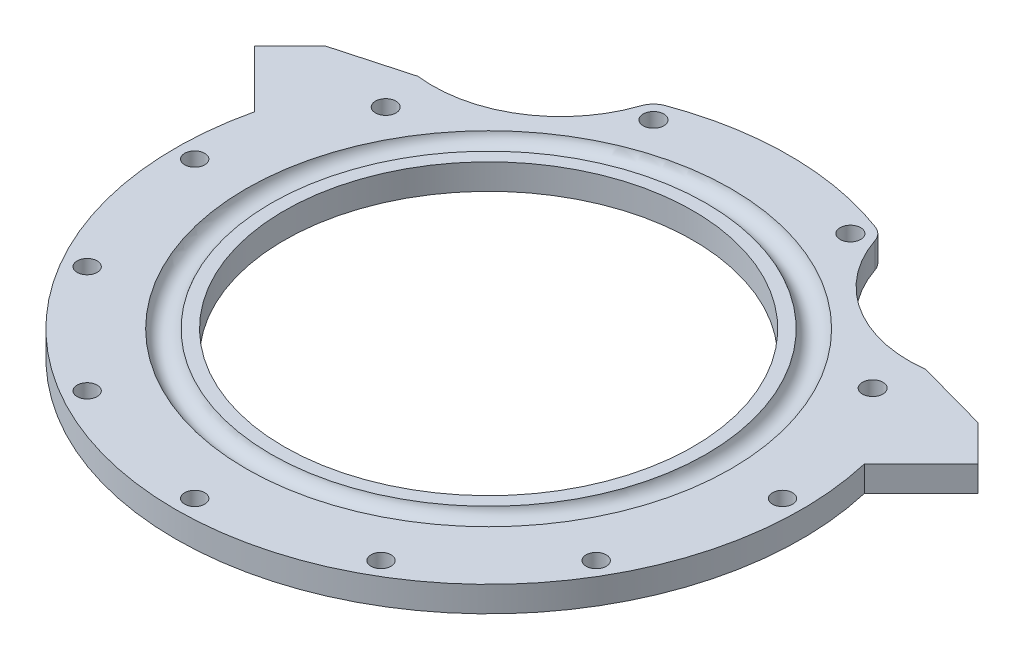
ISO-10303-21;
HEADER;
FILE_DESCRIPTION(('STEP AP214'),'2;1');
FILE_NAME('part.step','',(''),(''),'','','');
FILE_SCHEMA(('AUTOMOTIVE_DESIGN { 1 0 10303 214 1 1 1 1 }'));
ENDSEC;
DATA;
#1=APPLICATION_CONTEXT('core data for automotive mechanical design processes');
#2=APPLICATION_PROTOCOL_DEFINITION('international standard','automotive_design',2000,#1);
#3=PRODUCT_CONTEXT('',#1,'mechanical');
#4=PRODUCT('Part','Part','',(#3));
#5=PRODUCT_RELATED_PRODUCT_CATEGORY('part','',(#4));
#6=PRODUCT_DEFINITION_FORMATION('','',#4);
#7=PRODUCT_DEFINITION_CONTEXT('part definition',#1,'design');
#8=PRODUCT_DEFINITION('design','',#6,#7);
#9=PRODUCT_DEFINITION_SHAPE('','',#8);
#10=(LENGTH_UNIT() NAMED_UNIT(*) SI_UNIT(.MILLI.,.METRE.));
#11=(NAMED_UNIT(*) PLANE_ANGLE_UNIT() SI_UNIT($,.RADIAN.));
#12=(NAMED_UNIT(*) SI_UNIT($,.STERADIAN.) SOLID_ANGLE_UNIT());
#13=UNCERTAINTY_MEASURE_WITH_UNIT(LENGTH_MEASURE(1.E-05),#10,'distance_accuracy_value','');
#14=(GEOMETRIC_REPRESENTATION_CONTEXT(3) GLOBAL_UNCERTAINTY_ASSIGNED_CONTEXT((#13)) GLOBAL_UNIT_ASSIGNED_CONTEXT((#10,
#11,#12)) REPRESENTATION_CONTEXT('',''));
#15=CARTESIAN_POINT('',(0.,0.,0.));
#16=DIRECTION('',(0.,0.,1.));
#17=DIRECTION('',(1.,0.,0.));
#18=AXIS2_PLACEMENT_3D('',#15,#16,#17);
#19=CARTESIAN_POINT('',(59.1287540950455,-3.175,-77.0580926011515));
#20=DIRECTION('',(0.,1.,0.));
#21=DIRECTION('',(0.,0.,1.));
#22=AXIS2_PLACEMENT_3D('',#19,#20,#21);
#23=CYLINDRICAL_SURFACE('',#22,31.75);
#24=DIRECTION('',(0.,-1.,0.));
#25=VECTOR('',#24,1.);
#26=CARTESIAN_POINT('',(29.0279020516625,3.175,-66.9585279440802));
#27=LINE('',#26,#25);
#28=CARTESIAN_POINT('',(29.0279020516625,3.175,-66.9585279440802));
#29=VERTEX_POINT('',#28);
#30=CARTESIAN_POINT('',(29.0279020516625,-3.175,-66.9585279440802));
#31=VERTEX_POINT('',#30);
#32=EDGE_CURVE('E134',#29,#31,#27,.T.);
#33=ORIENTED_EDGE('',*,*,#32,.F.);
#34=CARTESIAN_POINT('',(59.1287540950455,3.175,-77.0580926011515));
#35=DIRECTION('',(0.,1.,0.));
#36=DIRECTION('',(0.,0.,1.));
#37=AXIS2_PLACEMENT_3D('',#34,#35,#36);
#38=CIRCLE('',#37,31.75);
#39=CARTESIAN_POINT('',(63.0549748577034,3.175,-45.5517870334897));
#40=VERTEX_POINT('',#39);
#41=EDGE_CURVE('E147',#29,#40,#38,.T.);
#42=ORIENTED_EDGE('',*,*,#41,.T.);
#43=DIRECTION('',(0.,1.,0.));
#44=VECTOR('',#43,1.);
#45=CARTESIAN_POINT('',(63.0549748577033,0.,-45.5517870334897));
#46=LINE('',#45,#44);
#47=CARTESIAN_POINT('',(63.0549748577034,-3.175,-45.5517870334897));
#48=VERTEX_POINT('',#47);
#49=EDGE_CURVE('E50',#40,#48,#46,.F.);
#50=ORIENTED_EDGE('',*,*,#49,.T.);
#51=CARTESIAN_POINT('',(59.1287540950455,-3.175,-77.0580926011515));
#52=DIRECTION('',(0.,1.,0.));
#53=DIRECTION('',(0.,0.,1.));
#54=AXIS2_PLACEMENT_3D('',#51,#52,#53);
#55=CIRCLE('',#54,31.75);
#56=EDGE_CURVE('E149',#31,#48,#55,.T.);
#57=ORIENTED_EDGE('',*,*,#56,.F.);
#58=EDGE_LOOP('',(#33,#42,#50,#57));
#59=FACE_BOUND('',#58,.T.);
#60=ADVANCED_FACE('F41',(#59),#23,.F.);
#61=CARTESIAN_POINT('',(-59.1287540950455,-3.175,-77.0580926011515));
#62=DIRECTION('',(0.,1.,0.));
#63=DIRECTION('',(0.,0.,1.));
#64=AXIS2_PLACEMENT_3D('',#61,#62,#63);
#65=CYLINDRICAL_SURFACE('',#64,31.75);
#66=CARTESIAN_POINT('',(-59.1287540950455,3.175,-77.0580926011515));
#67=DIRECTION('',(0.,-1.,0.));
#68=DIRECTION('',(0.,0.,1.));
#69=AXIS2_PLACEMENT_3D('',#66,#67,#68);
#70=CIRCLE('',#69,31.75);
#71=CARTESIAN_POINT('',(-29.0279020516625,3.175,-66.9585279440802));
#72=VERTEX_POINT('',#71);
#73=CARTESIAN_POINT('',(-63.0549748577034,3.175,-45.5517870334897));
#74=VERTEX_POINT('',#73);
#75=EDGE_CURVE('E286',#72,#74,#70,.T.);
#76=ORIENTED_EDGE('',*,*,#75,.F.);
#77=DIRECTION('',(0.,-1.,0.));
#78=VECTOR('',#77,1.);
#79=CARTESIAN_POINT('',(-29.0279020516625,3.175,-66.9585279440802));
#80=LINE('',#79,#78);
#81=CARTESIAN_POINT('',(-29.0279020516625,-3.175,-66.9585279440802));
#82=VERTEX_POINT('',#81);
#83=EDGE_CURVE('E673',#72,#82,#80,.T.);
#84=ORIENTED_EDGE('',*,*,#83,.T.);
#85=CARTESIAN_POINT('',(-59.1287540950455,-3.175,-77.0580926011515));
#86=DIRECTION('',(0.,-1.,0.));
#87=DIRECTION('',(0.,0.,1.));
#88=AXIS2_PLACEMENT_3D('',#85,#86,#87);
#89=CIRCLE('',#88,31.75);
#90=CARTESIAN_POINT('',(-63.0549748577034,-3.175,-45.5517870334897));
#91=VERTEX_POINT('',#90);
#92=EDGE_CURVE('E283',#82,#91,#89,.T.);
#93=ORIENTED_EDGE('',*,*,#92,.T.);
#94=DIRECTION('',(0.,1.,0.));
#95=VECTOR('',#94,1.);
#96=CARTESIAN_POINT('',(-63.0549748577033,0.,-45.5517870334897));
#97=LINE('',#96,#95);
#98=EDGE_CURVE('E11',#74,#91,#97,.F.);
#99=ORIENTED_EDGE('',*,*,#98,.F.);
#100=EDGE_LOOP('',(#76,#84,#93,#99));
#101=FACE_BOUND('',#100,.T.);
#102=ADVANCED_FACE('F365',(#101),#65,.F.);
#103=CARTESIAN_POINT('',(0.,3.175,0.));
#104=DIRECTION('',(0.,-1.,0.));
#105=DIRECTION('',(0.,0.,-1.));
#106=AXIS2_PLACEMENT_3D('',#103,#104,#105);
#107=CYLINDRICAL_SURFACE('',#106,77.7875);
#108=CARTESIAN_POINT('',(0.,3.175,0.));
#109=DIRECTION('',(0.,-1.,0.));
#110=DIRECTION('',(0.,0.,-1.));
#111=AXIS2_PLACEMENT_3D('',#108,#109,#110);
#112=CIRCLE('',#111,77.7875);
#113=CARTESIAN_POINT('',(75.7676127183567,3.175,-17.6114740783135));
#114=VERTEX_POINT('',#113);
#115=CARTESIAN_POINT('',(-75.7676127183567,3.175,-17.6114740783135));
#116=VERTEX_POINT('',#115);
#117=EDGE_CURVE('E246',#114,#116,#112,.T.);
#118=ORIENTED_EDGE('',*,*,#117,.T.);
#119=DIRECTION('',(0.,1.,0.));
#120=VECTOR('',#119,1.);
#121=CARTESIAN_POINT('',(-75.7676127183567,-3.175,-17.6114740783135));
#122=LINE('',#121,#120);
#123=CARTESIAN_POINT('',(-75.7676127183567,-3.175,-17.6114740783135));
#124=VERTEX_POINT('',#123);
#125=EDGE_CURVE('E692',#124,#116,#122,.T.);
#126=ORIENTED_EDGE('',*,*,#125,.F.);
#127=CARTESIAN_POINT('',(0.,-3.175,0.));
#128=DIRECTION('',(0.,-1.,0.));
#129=DIRECTION('',(0.,0.,-1.));
#130=AXIS2_PLACEMENT_3D('',#127,#128,#129);
#131=CIRCLE('',#130,77.7875);
#132=CARTESIAN_POINT('',(75.7676127183567,-3.175,-17.6114740783135));
#133=VERTEX_POINT('',#132);
#134=EDGE_CURVE('E242',#133,#124,#131,.T.);
#135=ORIENTED_EDGE('',*,*,#134,.F.);
#136=DIRECTION('',(0.,1.,0.));
#137=VECTOR('',#136,1.);
#138=CARTESIAN_POINT('',(75.7676127183567,-3.175,-17.6114740783135));
#139=LINE('',#138,#137);
#140=EDGE_CURVE('E293',#133,#114,#139,.T.);
#141=ORIENTED_EDGE('',*,*,#140,.T.);
#142=EDGE_LOOP('',(#118,#126,#135,#141));
#143=FACE_BOUND('',#142,.T.);
#144=ADVANCED_FACE('F332',(#143),#107,.T.);
#145=CARTESIAN_POINT('',(0.,3.175,0.));
#146=DIRECTION('',(0.,1.,0.));
#147=DIRECTION('',(0.,0.,1.));
#148=AXIS2_PLACEMENT_3D('',#145,#146,#147);
#149=PLANE('',#148);
#150=CARTESIAN_POINT('',(-24.4619855809739,3.175,-65.4265524190005));
#151=DIRECTION('',(0.,1.,0.));
#152=DIRECTION('',(0.,0.,-1.));
#153=AXIS2_PLACEMENT_3D('',#150,#151,#152);
#154=CIRCLE('',#153,4.81607124394442);
#155=CARTESIAN_POINT('',(-26.1486092792747,3.175,-69.9376324146422));
#156=VERTEX_POINT('',#155);
#157=EDGE_CURVE('E151',#156,#72,#154,.T.);
#158=ORIENTED_EDGE('',*,*,#157,.T.);
#159=ORIENTED_EDGE('',*,*,#75,.T.);
#160=DIRECTION('',(0.963853104598043,0.,-0.266434218441839));
#161=VECTOR('',#160,1.);
#162=CARTESIAN_POINT('',(-81.0019312332377,3.175,-40.5907786884272));
#163=LINE('',#162,#161);
#164=CARTESIAN_POINT('',(-81.0019312332382,3.175,-40.5907786884262));
#165=VERTEX_POINT('',#164);
#166=EDGE_CURVE('E676',#165,#74,#163,.T.);
#167=ORIENTED_EDGE('',*,*,#166,.F.);
#168=DIRECTION('',(-0.707106781186544,0.,0.707106781186551));
#169=VECTOR('',#168,1.);
#170=CARTESIAN_POINT('',(-81.0019312332382,3.175,-40.5907786884262));
#171=LINE('',#170,#169);
#172=CARTESIAN_POINT('',(-89.8744242808541,3.175,-31.7182856408109));
#173=VERTEX_POINT('',#172);
#174=EDGE_CURVE('E164',#165,#173,#171,.T.);
#175=ORIENTED_EDGE('',*,*,#174,.T.);
#176=DIRECTION('',(-0.707106781186547,0.,-0.707106781186548));
#177=VECTOR('',#176,1.);
#178=CARTESIAN_POINT('',(-75.7676127183567,3.175,-17.6114740783135));
#179=LINE('',#178,#177);
#180=EDGE_CURVE('E684',#116,#173,#179,.T.);
#181=ORIENTED_EDGE('',*,*,#180,.F.);
#182=ORIENTED_EDGE('',*,*,#117,.F.);
#183=DIRECTION('',(0.707106781186547,0.,-0.707106781186548));
#184=VECTOR('',#183,1.);
#185=CARTESIAN_POINT('',(75.7676127183567,3.175,-17.6114740783135));
#186=LINE('',#185,#184);
#187=CARTESIAN_POINT('',(89.8744242808541,3.175,-31.7182856408109));
#188=VERTEX_POINT('',#187);
#189=EDGE_CURVE('E276',#114,#188,#186,.T.);
#190=ORIENTED_EDGE('',*,*,#189,.T.);
#191=DIRECTION('',(-0.707106781186552,0.,-0.707106781186543));
#192=VECTOR('',#191,1.);
#193=CARTESIAN_POINT('',(87.7371233240396,3.175,-33.8555865976254));
#194=LINE('',#193,#192);
#195=CARTESIAN_POINT('',(81.0019312332377,3.175,-40.5907786884272));
#196=VERTEX_POINT('',#195);
#197=EDGE_CURVE('E178',#188,#196,#194,.T.);
#198=ORIENTED_EDGE('',*,*,#197,.T.);
#199=DIRECTION('',(-0.963853104598043,0.,-0.266434218441839));
#200=VECTOR('',#199,1.);
#201=CARTESIAN_POINT('',(81.0019312332377,3.175,-40.5907786884272));
#202=LINE('',#201,#200);
#203=EDGE_CURVE('E158',#196,#40,#202,.T.);
#204=ORIENTED_EDGE('',*,*,#203,.T.);
#205=ORIENTED_EDGE('',*,*,#41,.F.);
#206=CARTESIAN_POINT('',(24.4619855809739,3.175,-65.4265524190005));
#207=DIRECTION('',(0.,1.,0.));
#208=DIRECTION('',(0.,0.,-1.));
#209=AXIS2_PLACEMENT_3D('',#206,#207,#208);
#210=CIRCLE('',#209,4.8160712439444);
#211=CARTESIAN_POINT('',(26.1486092792747,3.175,-69.9376324146422));
#212=VERTEX_POINT('',#211);
#213=EDGE_CURVE('E130',#29,#212,#210,.T.);
#214=ORIENTED_EDGE('',*,*,#213,.T.);
#215=CARTESIAN_POINT('',(0.,3.175,0.));
#216=DIRECTION('',(0.,1.,0.));
#217=DIRECTION('',(0.,0.,-1.));
#218=AXIS2_PLACEMENT_3D('',#215,#216,#217);
#219=CIRCLE('',#218,74.6660712439444);
#220=EDGE_CURVE('E142',#212,#156,#219,.T.);
#221=ORIENTED_EDGE('',*,*,#220,.T.);
#222=EDGE_LOOP('',(#158,#159,#167,#175,#181,#182,#190,#198,#204,#205,#214,#221));
#223=FACE_BOUND('',#222,.T.);
#224=CARTESIAN_POINT('',(60.491874454343,3.175,-34.9250000000001));
#225=DIRECTION('',(0.,1.,0.));
#226=DIRECTION('',(0.,0.,1.));
#227=AXIS2_PLACEMENT_3D('',#224,#225,#226);
#228=CIRCLE('',#227,2.55270000000003);
#229=CARTESIAN_POINT('',(60.491874454343,3.175,-32.3723000000001));
#230=VERTEX_POINT('',#229);
#231=EDGE_CURVE('E297',#230,#230,#228,.T.);
#232=ORIENTED_EDGE('',*,*,#231,.F.);
#233=EDGE_LOOP('',(#232));
#234=FACE_BOUND('',#233,.T.);
#235=CARTESIAN_POINT('',(24.4619855809739,3.175,-65.4265524190005));
#236=DIRECTION('',(0.,1.,0.));
#237=DIRECTION('',(0.,0.,1.));
#238=AXIS2_PLACEMENT_3D('',#235,#236,#237);
#239=CIRCLE('',#238,2.55269999999998);
#240=CARTESIAN_POINT('',(24.4619855809739,3.175,-62.8738524190005));
#241=VERTEX_POINT('',#240);
#242=EDGE_CURVE('E313',#241,#241,#239,.T.);
#243=ORIENTED_EDGE('',*,*,#242,.F.);
#244=EDGE_LOOP('',(#243));
#245=FACE_BOUND('',#244,.T.);
#246=CARTESIAN_POINT('',(-60.4918744543429,3.175,-34.9250000000003));
#247=DIRECTION('',(0.,1.,0.));
#248=DIRECTION('',(0.,0.,1.));
#249=AXIS2_PLACEMENT_3D('',#246,#247,#248);
#250=CIRCLE('',#249,2.55269999999999);
#251=CARTESIAN_POINT('',(-60.4918744543429,3.175,-32.3723000000003));
#252=VERTEX_POINT('',#251);
#253=EDGE_CURVE('E305',#252,#252,#250,.T.);
#254=ORIENTED_EDGE('',*,*,#253,.F.);
#255=EDGE_LOOP('',(#254));
#256=FACE_BOUND('',#255,.T.);
#257=CARTESIAN_POINT('',(-24.4619855809739,3.175,-65.4265524190005));
#258=DIRECTION('',(0.,1.,0.));
#259=DIRECTION('',(0.,0.,1.));
#260=AXIS2_PLACEMENT_3D('',#257,#258,#259);
#261=CIRCLE('',#260,2.55269999999997);
#262=CARTESIAN_POINT('',(-24.4619855809739,3.175,-62.8738524190006));
#263=VERTEX_POINT('',#262);
#264=EDGE_CURVE('E167',#263,#263,#261,.T.);
#265=ORIENTED_EDGE('',*,*,#264,.F.);
#266=EDGE_LOOP('',(#265));
#267=FACE_BOUND('',#266,.T.);
#268=CARTESIAN_POINT('',(-36.5124999999992,3.175,63.2415051113591));
#269=DIRECTION('',(0.,1.,0.));
#270=DIRECTION('',(-0.499999999999989,0.,0.866025403784445));
#271=AXIS2_PLACEMENT_3D('',#268,#269,#270);
#272=CIRCLE('',#271,2.48919999999999);
#273=CARTESIAN_POINT('',(-37.7570999999992,3.175,65.3972155464593));
#274=VERTEX_POINT('',#273);
#275=EDGE_CURVE('E189',#274,#274,#272,.T.);
#276=ORIENTED_EDGE('',*,*,#275,.F.);
#277=EDGE_LOOP('',(#276));
#278=FACE_BOUND('',#277,.T.);
#279=CARTESIAN_POINT('',(-63.2415051113582,3.175,36.5125000000007));
#280=DIRECTION('',(0.,1.,0.));
#281=DIRECTION('',(-0.866025403784433,0.,0.50000000000001));
#282=AXIS2_PLACEMENT_3D('',#279,#280,#281);
#283=CIRCLE('',#282,2.48919999999999);
#284=CARTESIAN_POINT('',(-65.3972155464584,3.175,37.7571000000008));
#285=VERTEX_POINT('',#284);
#286=EDGE_CURVE('E219',#285,#285,#283,.T.);
#287=ORIENTED_EDGE('',*,*,#286,.F.);
#288=EDGE_LOOP('',(#287));
#289=FACE_BOUND('',#288,.T.);
#290=CARTESIAN_POINT('',(-73.025,3.175,7.6489627430706E-13));
#291=DIRECTION('',(0.,1.,0.));
#292=DIRECTION('',(-1.,0.,0.));
#293=AXIS2_PLACEMENT_3D('',#290,#291,#292);
#294=CIRCLE('',#293,2.48919999999999);
#295=CARTESIAN_POINT('',(-75.5142,3.175,7.90969260353004E-13));
#296=VERTEX_POINT('',#295);
#297=EDGE_CURVE('E211',#296,#296,#294,.T.);
#298=ORIENTED_EDGE('',*,*,#297,.F.);
#299=EDGE_LOOP('',(#298));
#300=FACE_BOUND('',#299,.T.);
#301=CARTESIAN_POINT('',(73.025,3.175,-2.5496542476902E-13));
#302=DIRECTION('',(0.,1.,0.));
#303=DIRECTION('',(1.,0.,0.));
#304=AXIS2_PLACEMENT_3D('',#301,#302,#303);
#305=CIRCLE('',#304,2.48919999999999);
#306=CARTESIAN_POINT('',(75.5142,3.175,-2.63656420117668E-13));
#307=VERTEX_POINT('',#306);
#308=EDGE_CURVE('E203',#307,#307,#305,.T.);
#309=ORIENTED_EDGE('',*,*,#308,.F.);
#310=EDGE_LOOP('',(#309));
#311=FACE_BOUND('',#310,.T.);
#312=CARTESIAN_POINT('',(63.2415051113587,3.175,36.5124999999999));
#313=DIRECTION('',(0.,1.,0.));
#314=DIRECTION('',(0.86602540378444,0.,0.499999999999998));
#315=AXIS2_PLACEMENT_3D('',#312,#313,#314);
#316=CIRCLE('',#315,2.48919999999999);
#317=CARTESIAN_POINT('',(65.3972155464589,3.175,37.7570999999999));
#318=VERTEX_POINT('',#317);
#319=EDGE_CURVE('E195',#318,#318,#316,.T.);
#320=ORIENTED_EDGE('',*,*,#319,.F.);
#321=EDGE_LOOP('',(#320));
#322=FACE_BOUND('',#321,.T.);
#323=CARTESIAN_POINT('',(36.5125000000001,3.175,63.2415051113586));
#324=DIRECTION('',(0.,1.,0.));
#325=DIRECTION('',(0.500000000000001,0.,0.866025403784438));
#326=AXIS2_PLACEMENT_3D('',#323,#324,#325);
#327=CIRCLE('',#326,2.48919999999999);
#328=CARTESIAN_POINT('',(37.7571000000001,3.175,65.3972155464588));
#329=VERTEX_POINT('',#328);
#330=EDGE_CURVE('E194',#329,#329,#327,.T.);
#331=ORIENTED_EDGE('',*,*,#330,.F.);
#332=EDGE_LOOP('',(#331));
#333=FACE_BOUND('',#332,.T.);
#334=CARTESIAN_POINT('',(0.,3.175,73.025));
#335=DIRECTION('',(0.,1.,0.));
#336=DIRECTION('',(0.,0.,1.));
#337=AXIS2_PLACEMENT_3D('',#334,#335,#336);
#338=CIRCLE('',#337,2.48919999999999);
#339=CARTESIAN_POINT('',(0.,3.175,75.5142));
#340=VERTEX_POINT('',#339);
#341=EDGE_CURVE('E234',#340,#340,#338,.T.);
#342=ORIENTED_EDGE('',*,*,#341,.F.);
#343=EDGE_LOOP('',(#342));
#344=FACE_BOUND('',#343,.T.);
#345=CARTESIAN_POINT('',(0.,3.175,0.));
#346=DIRECTION('',(0.,1.,0.));
#347=DIRECTION('',(0.,0.,1.));
#348=AXIS2_PLACEMENT_3D('',#345,#346,#347);
#349=CIRCLE('',#348,60.2608519733346);
#350=CARTESIAN_POINT('',(0.,3.175,60.2608519733346));
#351=VERTEX_POINT('',#350);
#352=EDGE_CURVE('E262',#351,#351,#349,.T.);
#353=ORIENTED_EDGE('',*,*,#352,.F.);
#354=EDGE_LOOP('',(#353));
#355=FACE_BOUND('',#354,.T.);
#356=ADVANCED_FACE('F155',(#223,#234,#245,#256,#267,#278,#289,#300,#311,#322,#333,#344,#355),
#149,.T.);
#357=CARTESIAN_POINT('',(0.,3.175,0.));
#358=DIRECTION('',(0.,1.,0.));
#359=DIRECTION('',(0.,0.,1.));
#360=AXIS2_PLACEMENT_3D('',#357,#358,#359);
#361=CIRCLE('',#360,50.8);
#362=CARTESIAN_POINT('',(0.,3.175,50.8));
#363=VERTEX_POINT('',#362);
#364=EDGE_CURVE('E254',#363,#363,#361,.T.);
#365=ORIENTED_EDGE('',*,*,#364,.F.);
#366=EDGE_LOOP('',(#365));
#367=FACE_BOUND('',#366,.T.);
#368=CARTESIAN_POINT('',(0.,3.175,0.));
#369=DIRECTION('',(0.,-1.,0.));
#370=DIRECTION('',(0.,0.,-1.));
#371=AXIS2_PLACEMENT_3D('',#368,#369,#370);
#372=CIRCLE('',#371,54.0391480266654);
#373=CARTESIAN_POINT('',(0.,3.175,-54.0391480266654));
#374=VERTEX_POINT('',#373);
#375=EDGE_CURVE('E250',#374,#374,#372,.T.);
#376=ORIENTED_EDGE('',*,*,#375,.F.);
#377=EDGE_LOOP('',(#376));
#378=FACE_BOUND('',#377,.T.);
#379=ADVANCED_FACE('F331',(#367,#378),#149,.T.);
#380=CARTESIAN_POINT('',(0.,-3.175,0.));
#381=DIRECTION('',(0.,1.,0.));
#382=DIRECTION('',(0.,0.,1.));
#383=AXIS2_PLACEMENT_3D('',#380,#381,#382);
#384=PLANE('',#383);
#385=ORIENTED_EDGE('',*,*,#92,.F.);
#386=CARTESIAN_POINT('',(-24.4619855809739,-3.175,-65.4265524190005));
#387=DIRECTION('',(0.,1.,0.));
#388=DIRECTION('',(0.,0.,-1.));
#389=AXIS2_PLACEMENT_3D('',#386,#387,#388);
#390=CIRCLE('',#389,4.81607124394442);
#391=CARTESIAN_POINT('',(-26.1486092792747,-3.175,-69.9376324146422));
#392=VERTEX_POINT('',#391);
#393=EDGE_CURVE('E57',#392,#82,#390,.T.);
#394=ORIENTED_EDGE('',*,*,#393,.F.);
#395=CARTESIAN_POINT('',(0.,-3.175,0.));
#396=DIRECTION('',(0.,1.,0.));
#397=DIRECTION('',(0.,0.,-1.));
#398=AXIS2_PLACEMENT_3D('',#395,#396,#397);
#399=CIRCLE('',#398,74.6660712439444);
#400=CARTESIAN_POINT('',(26.1486092792747,-3.175,-69.9376324146422));
#401=VERTEX_POINT('',#400);
#402=EDGE_CURVE('E660',#401,#392,#399,.T.);
#403=ORIENTED_EDGE('',*,*,#402,.F.);
#404=CARTESIAN_POINT('',(24.4619855809739,-3.175,-65.4265524190005));
#405=DIRECTION('',(0.,1.,0.));
#406=DIRECTION('',(0.,0.,-1.));
#407=AXIS2_PLACEMENT_3D('',#404,#405,#406);
#408=CIRCLE('',#407,4.8160712439444);
#409=EDGE_CURVE('E664',#31,#401,#408,.T.);
#410=ORIENTED_EDGE('',*,*,#409,.F.);
#411=ORIENTED_EDGE('',*,*,#56,.T.);
#412=DIRECTION('',(-0.963853104598043,0.,-0.266434218441839));
#413=VECTOR('',#412,1.);
#414=CARTESIAN_POINT('',(81.0019312332377,-3.175,-40.5907786884272));
#415=LINE('',#414,#413);
#416=CARTESIAN_POINT('',(81.0019312332377,-3.175,-40.5907786884272));
#417=VERTEX_POINT('',#416);
#418=EDGE_CURVE('E273',#417,#48,#415,.T.);
#419=ORIENTED_EDGE('',*,*,#418,.F.);
#420=DIRECTION('',(-0.707106781186552,0.,-0.707106781186543));
#421=VECTOR('',#420,1.);
#422=CARTESIAN_POINT('',(87.7371233240396,-3.175,-33.8555865976254));
#423=LINE('',#422,#421);
#424=CARTESIAN_POINT('',(89.8744242808541,-3.175,-31.7182856408109));
#425=VERTEX_POINT('',#424);
#426=EDGE_CURVE('E179',#425,#417,#423,.T.);
#427=ORIENTED_EDGE('',*,*,#426,.F.);
#428=DIRECTION('',(0.707106781186547,0.,-0.707106781186548));
#429=VECTOR('',#428,1.);
#430=CARTESIAN_POINT('',(75.7676127183567,-3.175,-17.6114740783135));
#431=LINE('',#430,#429);
#432=EDGE_CURVE('E281',#133,#425,#431,.T.);
#433=ORIENTED_EDGE('',*,*,#432,.F.);
#434=ORIENTED_EDGE('',*,*,#134,.T.);
#435=DIRECTION('',(-0.707106781186547,0.,-0.707106781186548));
#436=VECTOR('',#435,1.);
#437=CARTESIAN_POINT('',(-75.7676127183567,-3.175,-17.6114740783135));
#438=LINE('',#437,#436);
#439=CARTESIAN_POINT('',(-89.8744242808541,-3.175,-31.7182856408109));
#440=VERTEX_POINT('',#439);
#441=EDGE_CURVE('E688',#124,#440,#438,.T.);
#442=ORIENTED_EDGE('',*,*,#441,.T.);
#443=DIRECTION('',(-0.707106781186544,0.,0.707106781186551));
#444=VECTOR('',#443,1.);
#445=CARTESIAN_POINT('',(-81.0019312332382,-3.175,-40.5907786884262));
#446=LINE('',#445,#444);
#447=CARTESIAN_POINT('',(-81.0019312332382,-3.175,-40.5907786884262));
#448=VERTEX_POINT('',#447);
#449=EDGE_CURVE('E171',#448,#440,#446,.T.);
#450=ORIENTED_EDGE('',*,*,#449,.F.);
#451=DIRECTION('',(0.963853104598043,0.,-0.266434218441839));
#452=VECTOR('',#451,1.);
#453=CARTESIAN_POINT('',(-81.0019312332377,-3.175,-40.5907786884272));
#454=LINE('',#453,#452);
#455=EDGE_CURVE('E681',#448,#91,#454,.T.);
#456=ORIENTED_EDGE('',*,*,#455,.T.);
#457=EDGE_LOOP('',(#385,#394,#403,#410,#411,#419,#427,#433,#434,#442,#450,#456));
#458=FACE_BOUND('',#457,.T.);
#459=CARTESIAN_POINT('',(60.491874454343,-3.175,-34.9250000000001));
#460=DIRECTION('',(0.,1.,0.));
#461=DIRECTION('',(0.,0.,1.));
#462=AXIS2_PLACEMENT_3D('',#459,#460,#461);
#463=CIRCLE('',#462,2.55270000000003);
#464=CARTESIAN_POINT('',(60.491874454343,-3.175,-32.3723000000001));
#465=VERTEX_POINT('',#464);
#466=EDGE_CURVE('E317',#465,#465,#463,.T.);
#467=ORIENTED_EDGE('',*,*,#466,.T.);
#468=EDGE_LOOP('',(#467));
#469=FACE_BOUND('',#468,.T.);
#470=CARTESIAN_POINT('',(24.4619855809739,-3.175,-65.4265524190005));
#471=DIRECTION('',(0.,1.,0.));
#472=DIRECTION('',(0.,0.,1.));
#473=AXIS2_PLACEMENT_3D('',#470,#471,#472);
#474=CIRCLE('',#473,2.55269999999998);
#475=CARTESIAN_POINT('',(24.4619855809739,-3.175,-62.8738524190005));
#476=VERTEX_POINT('',#475);
#477=EDGE_CURVE('E309',#476,#476,#474,.T.);
#478=ORIENTED_EDGE('',*,*,#477,.T.);
#479=EDGE_LOOP('',(#478));
#480=FACE_BOUND('',#479,.T.);
#481=CARTESIAN_POINT('',(-60.4918744543429,-3.175,-34.9250000000003));
#482=DIRECTION('',(0.,1.,0.));
#483=DIRECTION('',(0.,0.,1.));
#484=AXIS2_PLACEMENT_3D('',#481,#482,#483);
#485=CIRCLE('',#484,2.55269999999999);
#486=CARTESIAN_POINT('',(-60.4918744543429,-3.175,-32.3723000000003));
#487=VERTEX_POINT('',#486);
#488=EDGE_CURVE('E301',#487,#487,#485,.T.);
#489=ORIENTED_EDGE('',*,*,#488,.T.);
#490=EDGE_LOOP('',(#489));
#491=FACE_BOUND('',#490,.T.);
#492=CARTESIAN_POINT('',(-24.4619855809739,-3.175,-65.4265524190005));
#493=DIRECTION('',(0.,1.,0.));
#494=DIRECTION('',(0.,0.,1.));
#495=AXIS2_PLACEMENT_3D('',#492,#493,#494);
#496=CIRCLE('',#495,2.55269999999997);
#497=CARTESIAN_POINT('',(-24.4619855809739,-3.175,-62.8738524190006));
#498=VERTEX_POINT('',#497);
#499=EDGE_CURVE('E160',#498,#498,#496,.T.);
#500=ORIENTED_EDGE('',*,*,#499,.T.);
#501=EDGE_LOOP('',(#500));
#502=FACE_BOUND('',#501,.T.);
#503=CARTESIAN_POINT('',(-36.5124999999992,-3.175,63.2415051113591));
#504=DIRECTION('',(0.,1.,0.));
#505=DIRECTION('',(-0.499999999999989,0.,0.866025403784445));
#506=AXIS2_PLACEMENT_3D('',#503,#504,#505);
#507=CIRCLE('',#506,2.48919999999999);
#508=CARTESIAN_POINT('',(-37.7570999999992,-3.175,65.3972155464593));
#509=VERTEX_POINT('',#508);
#510=EDGE_CURVE('E223',#509,#509,#507,.T.);
#511=ORIENTED_EDGE('',*,*,#510,.T.);
#512=EDGE_LOOP('',(#511));
#513=FACE_BOUND('',#512,.T.);
#514=CARTESIAN_POINT('',(-63.2415051113582,-3.175,36.5125000000007));
#515=DIRECTION('',(0.,1.,0.));
#516=DIRECTION('',(-0.866025403784433,0.,0.50000000000001));
#517=AXIS2_PLACEMENT_3D('',#514,#515,#516);
#518=CIRCLE('',#517,2.48919999999999);
#519=CARTESIAN_POINT('',(-65.3972155464584,-3.175,37.7571000000008));
#520=VERTEX_POINT('',#519);
#521=EDGE_CURVE('E215',#520,#520,#518,.T.);
#522=ORIENTED_EDGE('',*,*,#521,.T.);
#523=EDGE_LOOP('',(#522));
#524=FACE_BOUND('',#523,.T.);
#525=CARTESIAN_POINT('',(-73.025,-3.175,7.6489627430706E-13));
#526=DIRECTION('',(0.,1.,0.));
#527=DIRECTION('',(-1.,0.,0.));
#528=AXIS2_PLACEMENT_3D('',#525,#526,#527);
#529=CIRCLE('',#528,2.48919999999999);
#530=CARTESIAN_POINT('',(-75.5142,-3.175,7.90969260353004E-13));
#531=VERTEX_POINT('',#530);
#532=EDGE_CURVE('E207',#531,#531,#529,.T.);
#533=ORIENTED_EDGE('',*,*,#532,.T.);
#534=EDGE_LOOP('',(#533));
#535=FACE_BOUND('',#534,.T.);
#536=CARTESIAN_POINT('',(73.025,-3.175,-2.5496542476902E-13));
#537=DIRECTION('',(0.,1.,0.));
#538=DIRECTION('',(1.,0.,0.));
#539=AXIS2_PLACEMENT_3D('',#536,#537,#538);
#540=CIRCLE('',#539,2.48919999999999);
#541=CARTESIAN_POINT('',(75.5142,-3.175,-2.63656420117668E-13));
#542=VERTEX_POINT('',#541);
#543=EDGE_CURVE('E199',#542,#542,#540,.T.);
#544=ORIENTED_EDGE('',*,*,#543,.T.);
#545=EDGE_LOOP('',(#544));
#546=FACE_BOUND('',#545,.T.);
#547=CARTESIAN_POINT('',(63.2415051113587,-3.175,36.5124999999999));
#548=DIRECTION('',(0.,1.,0.));
#549=DIRECTION('',(0.86602540378444,0.,0.499999999999998));
#550=AXIS2_PLACEMENT_3D('',#547,#548,#549);
#551=CIRCLE('',#550,2.48919999999999);
#552=CARTESIAN_POINT('',(65.3972155464589,-3.175,37.7570999999999));
#553=VERTEX_POINT('',#552);
#554=EDGE_CURVE('E190',#553,#553,#551,.T.);
#555=ORIENTED_EDGE('',*,*,#554,.T.);
#556=EDGE_LOOP('',(#555));
#557=FACE_BOUND('',#556,.T.);
#558=CARTESIAN_POINT('',(36.5125000000001,-3.175,63.2415051113586));
#559=DIRECTION('',(0.,1.,0.));
#560=DIRECTION('',(0.500000000000001,0.,0.866025403784438));
#561=AXIS2_PLACEMENT_3D('',#558,#559,#560);
#562=CIRCLE('',#561,2.48919999999999);
#563=CARTESIAN_POINT('',(37.7571000000001,-3.175,65.3972155464588));
#564=VERTEX_POINT('',#563);
#565=EDGE_CURVE('E230',#564,#564,#562,.T.);
#566=ORIENTED_EDGE('',*,*,#565,.T.);
#567=EDGE_LOOP('',(#566));
#568=FACE_BOUND('',#567,.T.);
#569=CARTESIAN_POINT('',(0.,-3.175,73.025));
#570=DIRECTION('',(0.,1.,0.));
#571=DIRECTION('',(0.,0.,1.));
#572=AXIS2_PLACEMENT_3D('',#569,#570,#571);
#573=CIRCLE('',#572,2.48919999999999);
#574=CARTESIAN_POINT('',(0.,-3.175,75.5142));
#575=VERTEX_POINT('',#574);
#576=EDGE_CURVE('E238',#575,#575,#573,.T.);
#577=ORIENTED_EDGE('',*,*,#576,.T.);
#578=EDGE_LOOP('',(#577));
#579=FACE_BOUND('',#578,.T.);
#580=CARTESIAN_POINT('',(0.,-3.175,0.));
#581=DIRECTION('',(0.,1.,0.));
#582=DIRECTION('',(0.,0.,1.));
#583=AXIS2_PLACEMENT_3D('',#580,#581,#582);
#584=CIRCLE('',#583,50.8);
#585=CARTESIAN_POINT('',(0.,-3.175,50.8));
#586=VERTEX_POINT('',#585);
#587=EDGE_CURVE('E258',#586,#586,#584,.T.);
#588=ORIENTED_EDGE('',*,*,#587,.T.);
#589=EDGE_LOOP('',(#588));
#590=FACE_BOUND('',#589,.T.);
#591=ADVANCED_FACE('F43',(#458,#469,#480,#491,#502,#513,#524,#535,#546,#557,#568,#579,#590),
#384,.F.);
#592=CARTESIAN_POINT('',(0.,3.175,0.));
#593=DIRECTION('',(0.,-1.,0.));
#594=DIRECTION('',(0.,0.,-1.));
#595=AXIS2_PLACEMENT_3D('',#592,#593,#594);
#596=CYLINDRICAL_SURFACE('',#595,50.8);
#597=ORIENTED_EDGE('',*,*,#364,.T.);
#598=EDGE_LOOP('',(#597));
#599=FACE_BOUND('',#598,.T.);
#600=ORIENTED_EDGE('',*,*,#587,.F.);
#601=EDGE_LOOP('',(#600));
#602=FACE_BOUND('',#601,.T.);
#603=ADVANCED_FACE('F353',(#599,#602),#596,.F.);
#604=CARTESIAN_POINT('',(0.,3.81,0.));
#605=DIRECTION('',(0.,-1.,0.));
#606=DIRECTION('',(0.,0.,-1.));
#607=AXIS2_PLACEMENT_3D('',#604,#605,#606);
#608=TOROIDAL_SURFACE('',#607,57.15,3.175);
#609=ORIENTED_EDGE('',*,*,#352,.T.);
#610=EDGE_LOOP('',(#609));
#611=FACE_BOUND('',#610,.T.);
#612=ORIENTED_EDGE('',*,*,#375,.T.);
#613=EDGE_LOOP('',(#612));
#614=FACE_BOUND('',#613,.T.);
#615=ADVANCED_FACE('F349',(#611,#614),#608,.F.);
#616=CARTESIAN_POINT('',(0.,-3.175,73.025));
#617=DIRECTION('',(0.,1.,0.));
#618=DIRECTION('',(0.,0.,1.));
#619=AXIS2_PLACEMENT_3D('',#616,#617,#618);
#620=CYLINDRICAL_SURFACE('',#619,2.48919999999999);
#621=ORIENTED_EDGE('',*,*,#576,.F.);
#622=EDGE_LOOP('',(#621));
#623=FACE_BOUND('',#622,.T.);
#624=ORIENTED_EDGE('',*,*,#341,.T.);
#625=EDGE_LOOP('',(#624));
#626=FACE_BOUND('',#625,.T.);
#627=ADVANCED_FACE('F352',(#623,#626),#620,.F.);
#628=CARTESIAN_POINT('',(36.5125000000001,-3.175,63.2415051113586));
#629=DIRECTION('',(0.,1.,0.));
#630=DIRECTION('',(0.,0.,1.));
#631=AXIS2_PLACEMENT_3D('',#628,#629,#630);
#632=CYLINDRICAL_SURFACE('',#631,2.48919999999999);
#633=ORIENTED_EDGE('',*,*,#565,.F.);
#634=EDGE_LOOP('',(#633));
#635=FACE_BOUND('',#634,.T.);
#636=ORIENTED_EDGE('',*,*,#330,.T.);
#637=EDGE_LOOP('',(#636));
#638=FACE_BOUND('',#637,.T.);
#639=ADVANCED_FACE('F387',(#635,#638),#632,.F.);
#640=CARTESIAN_POINT('',(63.2415051113587,-3.175,36.5124999999999));
#641=DIRECTION('',(0.,1.,0.));
#642=DIRECTION('',(0.,0.,1.));
#643=AXIS2_PLACEMENT_3D('',#640,#641,#642);
#644=CYLINDRICAL_SURFACE('',#643,2.48919999999999);
#645=ORIENTED_EDGE('',*,*,#554,.F.);
#646=EDGE_LOOP('',(#645));
#647=FACE_BOUND('',#646,.T.);
#648=ORIENTED_EDGE('',*,*,#319,.T.);
#649=EDGE_LOOP('',(#648));
#650=FACE_BOUND('',#649,.T.);
#651=ADVANCED_FACE('F383',(#647,#650),#644,.F.);
#652=CARTESIAN_POINT('',(73.025,-3.175,-2.5496542476902E-13));
#653=DIRECTION('',(0.,1.,0.));
#654=DIRECTION('',(0.,0.,1.));
#655=AXIS2_PLACEMENT_3D('',#652,#653,#654);
#656=CYLINDRICAL_SURFACE('',#655,2.48919999999999);
#657=ORIENTED_EDGE('',*,*,#543,.F.);
#658=EDGE_LOOP('',(#657));
#659=FACE_BOUND('',#658,.T.);
#660=ORIENTED_EDGE('',*,*,#308,.T.);
#661=EDGE_LOOP('',(#660));
#662=FACE_BOUND('',#661,.T.);
#663=ADVANCED_FACE('F386',(#659,#662),#656,.F.);
#664=CARTESIAN_POINT('',(-73.025,-3.175,7.6489627430706E-13));
#665=DIRECTION('',(0.,1.,0.));
#666=DIRECTION('',(0.,0.,1.));
#667=AXIS2_PLACEMENT_3D('',#664,#665,#666);
#668=CYLINDRICAL_SURFACE('',#667,2.48919999999999);
#669=ORIENTED_EDGE('',*,*,#532,.F.);
#670=EDGE_LOOP('',(#669));
#671=FACE_BOUND('',#670,.T.);
#672=ORIENTED_EDGE('',*,*,#297,.T.);
#673=EDGE_LOOP('',(#672));
#674=FACE_BOUND('',#673,.T.);
#675=ADVANCED_FACE('F391',(#671,#674),#668,.F.);
#676=CARTESIAN_POINT('',(-63.2415051113582,-3.175,36.5125000000007));
#677=DIRECTION('',(0.,1.,0.));
#678=DIRECTION('',(0.,0.,1.));
#679=AXIS2_PLACEMENT_3D('',#676,#677,#678);
#680=CYLINDRICAL_SURFACE('',#679,2.48919999999999);
#681=ORIENTED_EDGE('',*,*,#521,.F.);
#682=EDGE_LOOP('',(#681));
#683=FACE_BOUND('',#682,.T.);
#684=ORIENTED_EDGE('',*,*,#286,.T.);
#685=EDGE_LOOP('',(#684));
#686=FACE_BOUND('',#685,.T.);
#687=ADVANCED_FACE('F395',(#683,#686),#680,.F.);
#688=CARTESIAN_POINT('',(-36.5124999999992,-3.175,63.2415051113591));
#689=DIRECTION('',(0.,1.,0.));
#690=DIRECTION('',(0.,0.,1.));
#691=AXIS2_PLACEMENT_3D('',#688,#689,#690);
#692=CYLINDRICAL_SURFACE('',#691,2.48919999999999);
#693=ORIENTED_EDGE('',*,*,#510,.F.);
#694=EDGE_LOOP('',(#693));
#695=FACE_BOUND('',#694,.T.);
#696=ORIENTED_EDGE('',*,*,#275,.T.);
#697=EDGE_LOOP('',(#696));
#698=FACE_BOUND('',#697,.T.);
#699=ADVANCED_FACE('F381',(#695,#698),#692,.F.);
#700=CARTESIAN_POINT('',(87.7371233240396,-3.175,-33.8555865976254));
#701=DIRECTION('',(0.707106781186543,0.,-0.707106781186552));
#702=DIRECTION('',(-0.707106781186552,0.,-0.707106781186543));
#703=AXIS2_PLACEMENT_3D('',#700,#701,#702);
#704=PLANE('',#703);
#705=ORIENTED_EDGE('',*,*,#197,.F.);
#706=DIRECTION('',(0.,1.,0.));
#707=VECTOR('',#706,1.);
#708=CARTESIAN_POINT('',(89.8744242808541,-3.175,-31.7182856408109));
#709=LINE('',#708,#707);
#710=EDGE_CURVE('E291',#425,#188,#709,.T.);
#711=ORIENTED_EDGE('',*,*,#710,.F.);
#712=ORIENTED_EDGE('',*,*,#426,.T.);
#713=DIRECTION('',(0.,1.,0.));
#714=VECTOR('',#713,1.);
#715=CARTESIAN_POINT('',(81.0019312332377,-3.175,-40.5907786884272));
#716=LINE('',#715,#714);
#717=EDGE_CURVE('E183',#417,#196,#716,.T.);
#718=ORIENTED_EDGE('',*,*,#717,.T.);
#719=EDGE_LOOP('',(#705,#711,#712,#718));
#720=FACE_BOUND('',#719,.T.);
#721=ADVANCED_FACE('F378',(#720),#704,.T.);
#722=CARTESIAN_POINT('',(-81.0019312332382,-3.175,-40.5907786884262));
#723=DIRECTION('',(-0.707106781186551,0.,-0.707106781186544));
#724=DIRECTION('',(-0.707106781186544,0.,0.707106781186551));
#725=AXIS2_PLACEMENT_3D('',#722,#723,#724);
#726=PLANE('',#725);
#727=ORIENTED_EDGE('',*,*,#174,.F.);
#728=DIRECTION('',(0.,1.,0.));
#729=VECTOR('',#728,1.);
#730=CARTESIAN_POINT('',(-81.0019312332382,-3.175,-40.5907786884262));
#731=LINE('',#730,#729);
#732=EDGE_CURVE('E66',#448,#165,#731,.T.);
#733=ORIENTED_EDGE('',*,*,#732,.F.);
#734=ORIENTED_EDGE('',*,*,#449,.T.);
#735=DIRECTION('',(0.,1.,0.));
#736=VECTOR('',#735,1.);
#737=CARTESIAN_POINT('',(-89.8744242808541,-3.175,-31.7182856408109));
#738=LINE('',#737,#736);
#739=EDGE_CURVE('E696',#440,#173,#738,.T.);
#740=ORIENTED_EDGE('',*,*,#739,.T.);
#741=EDGE_LOOP('',(#727,#733,#734,#740));
#742=FACE_BOUND('',#741,.T.);
#743=ADVANCED_FACE('F375',(#742),#726,.T.);
#744=CARTESIAN_POINT('',(-24.4619855809739,-3.175,-65.4265524190005));
#745=DIRECTION('',(0.,1.,0.));
#746=DIRECTION('',(0.,0.,1.));
#747=AXIS2_PLACEMENT_3D('',#744,#745,#746);
#748=CYLINDRICAL_SURFACE('',#747,2.55269999999997);
#749=ORIENTED_EDGE('',*,*,#499,.F.);
#750=EDGE_LOOP('',(#749));
#751=FACE_BOUND('',#750,.T.);
#752=ORIENTED_EDGE('',*,*,#264,.T.);
#753=EDGE_LOOP('',(#752));
#754=FACE_BOUND('',#753,.T.);
#755=ADVANCED_FACE('F327',(#751,#754),#748,.F.);
#756=CARTESIAN_POINT('',(-60.4918744543429,-3.175,-34.9250000000003));
#757=DIRECTION('',(0.,1.,0.));
#758=DIRECTION('',(0.,0.,1.));
#759=AXIS2_PLACEMENT_3D('',#756,#757,#758);
#760=CYLINDRICAL_SURFACE('',#759,2.55269999999999);
#761=ORIENTED_EDGE('',*,*,#488,.F.);
#762=EDGE_LOOP('',(#761));
#763=FACE_BOUND('',#762,.T.);
#764=ORIENTED_EDGE('',*,*,#253,.T.);
#765=EDGE_LOOP('',(#764));
#766=FACE_BOUND('',#765,.T.);
#767=ADVANCED_FACE('F470',(#763,#766),#760,.F.);
#768=CARTESIAN_POINT('',(24.4619855809739,-3.175,-65.4265524190005));
#769=DIRECTION('',(0.,1.,0.));
#770=DIRECTION('',(0.,0.,1.));
#771=AXIS2_PLACEMENT_3D('',#768,#769,#770);
#772=CYLINDRICAL_SURFACE('',#771,2.55269999999998);
#773=ORIENTED_EDGE('',*,*,#477,.F.);
#774=EDGE_LOOP('',(#773));
#775=FACE_BOUND('',#774,.T.);
#776=ORIENTED_EDGE('',*,*,#242,.T.);
#777=EDGE_LOOP('',(#776));
#778=FACE_BOUND('',#777,.T.);
#779=ADVANCED_FACE('F477',(#775,#778),#772,.F.);
#780=CARTESIAN_POINT('',(60.491874454343,-3.175,-34.9250000000001));
#781=DIRECTION('',(0.,1.,0.));
#782=DIRECTION('',(0.,0.,1.));
#783=AXIS2_PLACEMENT_3D('',#780,#781,#782);
#784=CYLINDRICAL_SURFACE('',#783,2.55270000000003);
#785=ORIENTED_EDGE('',*,*,#466,.F.);
#786=EDGE_LOOP('',(#785));
#787=FACE_BOUND('',#786,.T.);
#788=ORIENTED_EDGE('',*,*,#231,.T.);
#789=EDGE_LOOP('',(#788));
#790=FACE_BOUND('',#789,.T.);
#791=ADVANCED_FACE('F485',(#787,#790),#784,.F.);
#792=CARTESIAN_POINT('',(75.7676127183567,-3.175,-17.6114740783135));
#793=DIRECTION('',(0.707106781186548,0.,0.707106781186547));
#794=DIRECTION('',(0.707106781186547,0.,-0.707106781186548));
#795=AXIS2_PLACEMENT_3D('',#792,#793,#794);
#796=PLANE('',#795);
#797=ORIENTED_EDGE('',*,*,#189,.F.);
#798=ORIENTED_EDGE('',*,*,#140,.F.);
#799=ORIENTED_EDGE('',*,*,#432,.T.);
#800=ORIENTED_EDGE('',*,*,#710,.T.);
#801=EDGE_LOOP('',(#797,#798,#799,#800));
#802=FACE_BOUND('',#801,.T.);
#803=ADVANCED_FACE('F492',(#802),#796,.T.);
#804=CARTESIAN_POINT('',(81.0019312332377,-3.175,-40.5907786884272));
#805=DIRECTION('',(0.266434218441839,0.,-0.963853104598043));
#806=DIRECTION('',(-0.963853104598043,0.,-0.266434218441839));
#807=AXIS2_PLACEMENT_3D('',#804,#805,#806);
#808=PLANE('',#807);
#809=ORIENTED_EDGE('',*,*,#203,.F.);
#810=ORIENTED_EDGE('',*,*,#717,.F.);
#811=ORIENTED_EDGE('',*,*,#418,.T.);
#812=ORIENTED_EDGE('',*,*,#49,.F.);
#813=EDGE_LOOP('',(#809,#810,#811,#812));
#814=FACE_BOUND('',#813,.T.);
#815=ADVANCED_FACE('F271',(#814),#808,.T.);
#816=CARTESIAN_POINT('',(-75.7676127183567,-3.175,-17.6114740783135));
#817=DIRECTION('',(0.707106781186548,0.,-0.707106781186547));
#818=DIRECTION('',(-0.707106781186547,0.,-0.707106781186548));
#819=AXIS2_PLACEMENT_3D('',#816,#817,#818);
#820=PLANE('',#819);
#821=ORIENTED_EDGE('',*,*,#180,.T.);
#822=ORIENTED_EDGE('',*,*,#739,.F.);
#823=ORIENTED_EDGE('',*,*,#441,.F.);
#824=ORIENTED_EDGE('',*,*,#125,.T.);
#825=EDGE_LOOP('',(#821,#822,#823,#824));
#826=FACE_BOUND('',#825,.T.);
#827=ADVANCED_FACE('F505',(#826),#820,.F.);
#828=CARTESIAN_POINT('',(-81.0019312332377,-3.175,-40.5907786884272));
#829=DIRECTION('',(0.266434218441839,0.,0.963853104598043));
#830=DIRECTION('',(0.963853104598043,0.,-0.266434218441839));
#831=AXIS2_PLACEMENT_3D('',#828,#829,#830);
#832=PLANE('',#831);
#833=ORIENTED_EDGE('',*,*,#166,.T.);
#834=ORIENTED_EDGE('',*,*,#98,.T.);
#835=ORIENTED_EDGE('',*,*,#455,.F.);
#836=ORIENTED_EDGE('',*,*,#732,.T.);
#837=EDGE_LOOP('',(#833,#834,#835,#836));
#838=FACE_BOUND('',#837,.T.);
#839=ADVANCED_FACE('F511',(#838),#832,.F.);
#840=CARTESIAN_POINT('',(-24.4619855809739,3.175,-65.4265524190005));
#841=DIRECTION('',(0.,-1.,0.));
#842=DIRECTION('',(0.,0.,-1.));
#843=AXIS2_PLACEMENT_3D('',#840,#841,#842);
#844=CYLINDRICAL_SURFACE('',#843,4.81607124394442);
#845=ORIENTED_EDGE('',*,*,#393,.T.);
#846=ORIENTED_EDGE('',*,*,#83,.F.);
#847=ORIENTED_EDGE('',*,*,#157,.F.);
#848=DIRECTION('',(0.,-1.,0.));
#849=VECTOR('',#848,1.);
#850=CARTESIAN_POINT('',(-26.1486092792747,3.175,-69.9376324146422));
#851=LINE('',#850,#849);
#852=EDGE_CURVE('E661',#156,#392,#851,.T.);
#853=ORIENTED_EDGE('',*,*,#852,.T.);
#854=EDGE_LOOP('',(#845,#846,#847,#853));
#855=FACE_BOUND('',#854,.T.);
#856=ADVANCED_FACE('F519',(#855),#844,.T.);
#857=CARTESIAN_POINT('',(0.,3.175,0.));
#858=DIRECTION('',(0.,-1.,0.));
#859=DIRECTION('',(0.,0.,-1.));
#860=AXIS2_PLACEMENT_3D('',#857,#858,#859);
#861=CYLINDRICAL_SURFACE('',#860,74.6660712439444);
#862=ORIENTED_EDGE('',*,*,#402,.T.);
#863=ORIENTED_EDGE('',*,*,#852,.F.);
#864=ORIENTED_EDGE('',*,*,#220,.F.);
#865=DIRECTION('',(0.,-1.,0.));
#866=VECTOR('',#865,1.);
#867=CARTESIAN_POINT('',(26.1486092792747,3.175,-69.9376324146422));
#868=LINE('',#867,#866);
#869=EDGE_CURVE('E136',#212,#401,#868,.T.);
#870=ORIENTED_EDGE('',*,*,#869,.T.);
#871=EDGE_LOOP('',(#862,#863,#864,#870));
#872=FACE_BOUND('',#871,.T.);
#873=ADVANCED_FACE('F527',(#872),#861,.T.);
#874=CARTESIAN_POINT('',(24.4619855809739,3.175,-65.4265524190005));
#875=DIRECTION('',(0.,-1.,0.));
#876=DIRECTION('',(0.,0.,-1.));
#877=AXIS2_PLACEMENT_3D('',#874,#875,#876);
#878=CYLINDRICAL_SURFACE('',#877,4.8160712439444);
#879=ORIENTED_EDGE('',*,*,#409,.T.);
#880=ORIENTED_EDGE('',*,*,#869,.F.);
#881=ORIENTED_EDGE('',*,*,#213,.F.);
#882=ORIENTED_EDGE('',*,*,#32,.T.);
#883=EDGE_LOOP('',(#879,#880,#881,#882));
#884=FACE_BOUND('',#883,.T.);
#885=ADVANCED_FACE('F133',(#884),#878,.T.);
#886=CLOSED_SHELL('',(#60,#102,#144,#356,#379,#591,#603,#615,#627,#639,#651,#663,#675,#687,#699,
#721,#743,#755,#767,#779,#791,#803,#815,#827,#839,#856,#873,#885));
#887=MANIFOLD_SOLID_BREP('B2',#886);
#888=ADVANCED_BREP_SHAPE_REPRESENTATION('',(#18,#887),#14);
#889=SHAPE_DEFINITION_REPRESENTATION(#9,#888);
ENDSEC;
END-ISO-10303-21;
